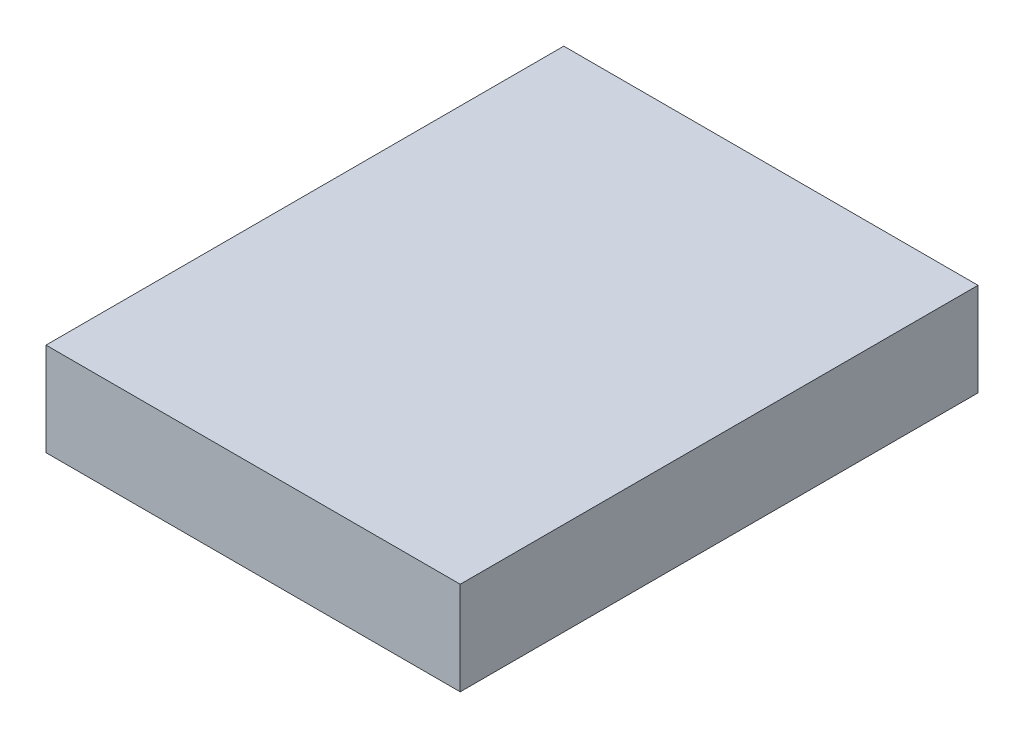
ISO-10303-21;
HEADER;
FILE_DESCRIPTION(('STEP AP214'),'2;1');
FILE_NAME('part.step','',(''),(''),'','','');
FILE_SCHEMA(('AUTOMOTIVE_DESIGN { 1 0 10303 214 1 1 1 1 }'));
ENDSEC;
DATA;
#1=APPLICATION_CONTEXT('core data for automotive mechanical design processes');
#2=APPLICATION_PROTOCOL_DEFINITION('international standard','automotive_design',2000,#1);
#3=PRODUCT_CONTEXT('',#1,'mechanical');
#4=PRODUCT('Part','Part','',(#3));
#5=PRODUCT_RELATED_PRODUCT_CATEGORY('part','',(#4));
#6=PRODUCT_DEFINITION_FORMATION('','',#4);
#7=PRODUCT_DEFINITION_CONTEXT('part definition',#1,'design');
#8=PRODUCT_DEFINITION('design','',#6,#7);
#9=PRODUCT_DEFINITION_SHAPE('','',#8);
#10=(LENGTH_UNIT() NAMED_UNIT(*) SI_UNIT(.MILLI.,.METRE.));
#11=(NAMED_UNIT(*) PLANE_ANGLE_UNIT() SI_UNIT($,.RADIAN.));
#12=(NAMED_UNIT(*) SI_UNIT($,.STERADIAN.) SOLID_ANGLE_UNIT());
#13=UNCERTAINTY_MEASURE_WITH_UNIT(LENGTH_MEASURE(1.E-05),#10,'distance_accuracy_value','');
#14=(GEOMETRIC_REPRESENTATION_CONTEXT(3) GLOBAL_UNCERTAINTY_ASSIGNED_CONTEXT((#13)) GLOBAL_UNIT_ASSIGNED_CONTEXT((#10,
#11,#12)) REPRESENTATION_CONTEXT('',''));
#15=CARTESIAN_POINT('',(0.,0.,0.));
#16=DIRECTION('',(0.,0.,1.));
#17=DIRECTION('',(1.,0.,0.));
#18=AXIS2_PLACEMENT_3D('',#15,#16,#17);
#19=CARTESIAN_POINT('',(4.,1.8,5.));
#20=DIRECTION('',(-1.,0.,0.));
#21=DIRECTION('',(0.,0.,1.));
#22=AXIS2_PLACEMENT_3D('',#19,#20,#21);
#23=PLANE('',#22);
#24=DIRECTION('',(0.,0.,-1.));
#25=VECTOR('',#24,1.);
#26=CARTESIAN_POINT('',(4.,0.,5.));
#27=LINE('',#26,#25);
#28=CARTESIAN_POINT('',(4.,0.,5.));
#29=VERTEX_POINT('',#28);
#30=CARTESIAN_POINT('',(4.,0.,-5.));
#31=VERTEX_POINT('',#30);
#32=EDGE_CURVE('E98',#29,#31,#27,.T.);
#33=ORIENTED_EDGE('',*,*,#32,.T.);
#34=DIRECTION('',(0.,-1.,0.));
#35=VECTOR('',#34,1.);
#36=CARTESIAN_POINT('',(4.,1.8,-5.));
#37=LINE('',#36,#35);
#38=CARTESIAN_POINT('',(4.,1.8,-5.));
#39=VERTEX_POINT('',#38);
#40=EDGE_CURVE('E11',#39,#31,#37,.T.);
#41=ORIENTED_EDGE('',*,*,#40,.F.);
#42=DIRECTION('',(0.,0.,-1.));
#43=VECTOR('',#42,1.);
#44=CARTESIAN_POINT('',(4.,1.8,5.));
#45=LINE('',#44,#43);
#46=CARTESIAN_POINT('',(4.,1.8,5.));
#47=VERTEX_POINT('',#46);
#48=EDGE_CURVE('E86',#47,#39,#45,.T.);
#49=ORIENTED_EDGE('',*,*,#48,.F.);
#50=DIRECTION('',(0.,-1.,0.));
#51=VECTOR('',#50,1.);
#52=CARTESIAN_POINT('',(4.,1.8,5.));
#53=LINE('',#52,#51);
#54=EDGE_CURVE('E94',#47,#29,#53,.T.);
#55=ORIENTED_EDGE('',*,*,#54,.T.);
#56=EDGE_LOOP('',(#33,#41,#49,#55));
#57=FACE_BOUND('',#56,.T.);
#58=ADVANCED_FACE('F35',(#57),#23,.F.);
#59=CARTESIAN_POINT('',(-4.,1.8,-5.));
#60=DIRECTION('',(0.,0.,1.));
#61=DIRECTION('',(1.,0.,0.));
#62=AXIS2_PLACEMENT_3D('',#59,#60,#61);
#63=PLANE('',#62);
#64=DIRECTION('',(-1.,0.,0.));
#65=VECTOR('',#64,1.);
#66=CARTESIAN_POINT('',(-4.,0.,-5.));
#67=LINE('',#66,#65);
#68=CARTESIAN_POINT('',(-4.,0.,-5.));
#69=VERTEX_POINT('',#68);
#70=EDGE_CURVE('E90',#31,#69,#67,.T.);
#71=ORIENTED_EDGE('',*,*,#70,.T.);
#72=DIRECTION('',(0.,-1.,0.));
#73=VECTOR('',#72,1.);
#74=CARTESIAN_POINT('',(-4.,1.8,-5.));
#75=LINE('',#74,#73);
#76=CARTESIAN_POINT('',(-4.,1.8,-5.));
#77=VERTEX_POINT('',#76);
#78=EDGE_CURVE('E43',#77,#69,#75,.T.);
#79=ORIENTED_EDGE('',*,*,#78,.F.);
#80=DIRECTION('',(-1.,0.,0.));
#81=VECTOR('',#80,1.);
#82=CARTESIAN_POINT('',(-4.,1.8,-5.));
#83=LINE('',#82,#81);
#84=EDGE_CURVE('E81',#39,#77,#83,.T.);
#85=ORIENTED_EDGE('',*,*,#84,.F.);
#86=ORIENTED_EDGE('',*,*,#40,.T.);
#87=EDGE_LOOP('',(#71,#79,#85,#86));
#88=FACE_BOUND('',#87,.T.);
#89=ADVANCED_FACE('F89',(#88),#63,.F.);
#90=CARTESIAN_POINT('',(-4.,1.8,5.));
#91=DIRECTION('',(1.,0.,0.));
#92=DIRECTION('',(0.,0.,-1.));
#93=AXIS2_PLACEMENT_3D('',#90,#91,#92);
#94=PLANE('',#93);
#95=DIRECTION('',(0.,0.,1.));
#96=VECTOR('',#95,1.);
#97=CARTESIAN_POINT('',(-4.,0.,5.));
#98=LINE('',#97,#96);
#99=CARTESIAN_POINT('',(-4.,0.,5.));
#100=VERTEX_POINT('',#99);
#101=EDGE_CURVE('E68',#69,#100,#98,.T.);
#102=ORIENTED_EDGE('',*,*,#101,.T.);
#103=DIRECTION('',(0.,-1.,0.));
#104=VECTOR('',#103,1.);
#105=CARTESIAN_POINT('',(-4.,1.8,5.));
#106=LINE('',#105,#104);
#107=CARTESIAN_POINT('',(-4.,1.8,5.));
#108=VERTEX_POINT('',#107);
#109=EDGE_CURVE('E91',#108,#100,#106,.T.);
#110=ORIENTED_EDGE('',*,*,#109,.F.);
#111=DIRECTION('',(0.,0.,1.));
#112=VECTOR('',#111,1.);
#113=CARTESIAN_POINT('',(-4.,1.8,5.));
#114=LINE('',#113,#112);
#115=EDGE_CURVE('E84',#77,#108,#114,.T.);
#116=ORIENTED_EDGE('',*,*,#115,.F.);
#117=ORIENTED_EDGE('',*,*,#78,.T.);
#118=EDGE_LOOP('',(#102,#110,#116,#117));
#119=FACE_BOUND('',#118,.T.);
#120=ADVANCED_FACE('F92',(#119),#94,.F.);
#121=CARTESIAN_POINT('',(-4.,1.8,5.));
#122=DIRECTION('',(0.,0.,-1.));
#123=DIRECTION('',(-1.,0.,0.));
#124=AXIS2_PLACEMENT_3D('',#121,#122,#123);
#125=PLANE('',#124);
#126=DIRECTION('',(1.,0.,0.));
#127=VECTOR('',#126,1.);
#128=CARTESIAN_POINT('',(-4.,0.,5.));
#129=LINE('',#128,#127);
#130=EDGE_CURVE('E74',#100,#29,#129,.T.);
#131=ORIENTED_EDGE('',*,*,#130,.T.);
#132=ORIENTED_EDGE('',*,*,#54,.F.);
#133=DIRECTION('',(1.,0.,0.));
#134=VECTOR('',#133,1.);
#135=CARTESIAN_POINT('',(-4.,1.8,5.));
#136=LINE('',#135,#134);
#137=EDGE_CURVE('E51',#108,#47,#136,.T.);
#138=ORIENTED_EDGE('',*,*,#137,.F.);
#139=ORIENTED_EDGE('',*,*,#109,.T.);
#140=EDGE_LOOP('',(#131,#132,#138,#139));
#141=FACE_BOUND('',#140,.T.);
#142=ADVANCED_FACE('F105',(#141),#125,.F.);
#143=CARTESIAN_POINT('',(0.,1.8,0.));
#144=DIRECTION('',(0.,-1.,0.));
#145=DIRECTION('',(0.,0.,-1.));
#146=AXIS2_PLACEMENT_3D('',#143,#144,#145);
#147=PLANE('',#146);
#148=ORIENTED_EDGE('',*,*,#48,.T.);
#149=ORIENTED_EDGE('',*,*,#84,.T.);
#150=ORIENTED_EDGE('',*,*,#115,.T.);
#151=ORIENTED_EDGE('',*,*,#137,.T.);
#152=EDGE_LOOP('',(#148,#149,#150,#151));
#153=FACE_BOUND('',#152,.T.);
#154=ADVANCED_FACE('F82',(#153),#147,.F.);
#155=CARTESIAN_POINT('',(0.,0.,0.));
#156=DIRECTION('',(0.,-1.,0.));
#157=DIRECTION('',(0.,0.,-1.));
#158=AXIS2_PLACEMENT_3D('',#155,#156,#157);
#159=PLANE('',#158);
#160=ORIENTED_EDGE('',*,*,#32,.F.);
#161=ORIENTED_EDGE('',*,*,#130,.F.);
#162=ORIENTED_EDGE('',*,*,#101,.F.);
#163=ORIENTED_EDGE('',*,*,#70,.F.);
#164=EDGE_LOOP('',(#160,#161,#162,#163));
#165=FACE_BOUND('',#164,.T.);
#166=ADVANCED_FACE('F108',(#165),#159,.T.);
#167=CLOSED_SHELL('',(#58,#89,#120,#142,#154,#166));
#168=MANIFOLD_SOLID_BREP('B2',#167);
#169=ADVANCED_BREP_SHAPE_REPRESENTATION('',(#18,#168),#14);
#170=SHAPE_DEFINITION_REPRESENTATION(#9,#169);
ENDSEC;
END-ISO-10303-21;
